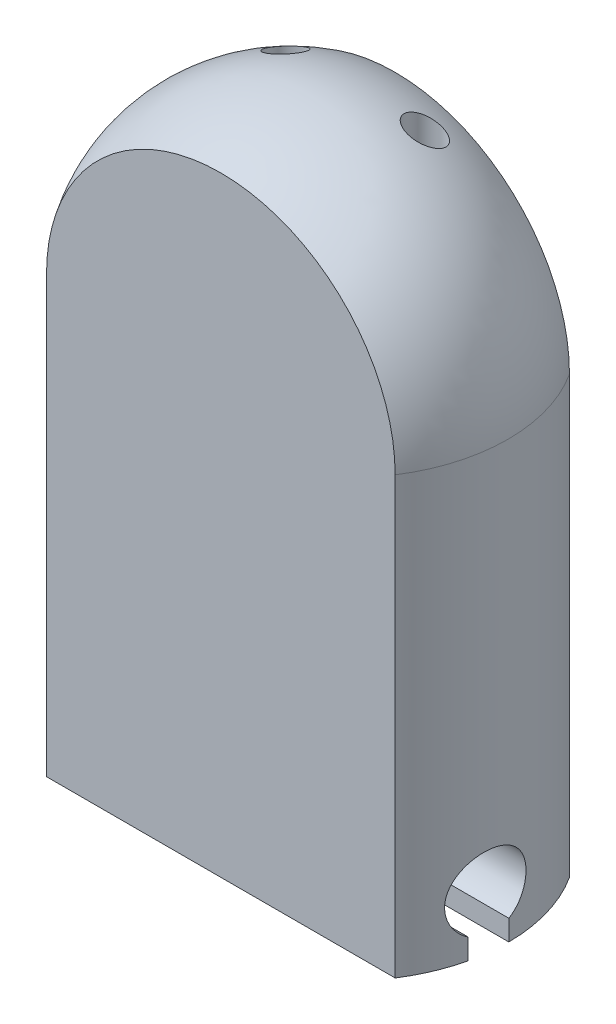
ISO-10303-21;
HEADER;
FILE_DESCRIPTION(('STEP AP214'),'2;1');
FILE_NAME('part.step','',(''),(''),'','','');
FILE_SCHEMA(('AUTOMOTIVE_DESIGN { 1 0 10303 214 1 1 1 1 }'));
ENDSEC;
DATA;
#1=APPLICATION_CONTEXT('core data for automotive mechanical design processes');
#2=APPLICATION_PROTOCOL_DEFINITION('international standard','automotive_design',2000,#1);
#3=PRODUCT_CONTEXT('',#1,'mechanical');
#4=PRODUCT('Part','Part','',(#3));
#5=PRODUCT_RELATED_PRODUCT_CATEGORY('part','',(#4));
#6=PRODUCT_DEFINITION_FORMATION('','',#4);
#7=PRODUCT_DEFINITION_CONTEXT('part definition',#1,'design');
#8=PRODUCT_DEFINITION('design','',#6,#7);
#9=PRODUCT_DEFINITION_SHAPE('','',#8);
#10=(LENGTH_UNIT() NAMED_UNIT(*) SI_UNIT(.MILLI.,.METRE.));
#11=(NAMED_UNIT(*) PLANE_ANGLE_UNIT() SI_UNIT($,.RADIAN.));
#12=(NAMED_UNIT(*) SI_UNIT($,.STERADIAN.) SOLID_ANGLE_UNIT());
#13=UNCERTAINTY_MEASURE_WITH_UNIT(LENGTH_MEASURE(1.E-05),#10,'distance_accuracy_value','');
#14=(GEOMETRIC_REPRESENTATION_CONTEXT(3) GLOBAL_UNCERTAINTY_ASSIGNED_CONTEXT((#13)) GLOBAL_UNIT_ASSIGNED_CONTEXT((#10,
#11,#12)) REPRESENTATION_CONTEXT('',''));
#15=CARTESIAN_POINT('',(0.,0.,0.));
#16=DIRECTION('',(0.,0.,1.));
#17=DIRECTION('',(1.,0.,0.));
#18=AXIS2_PLACEMENT_3D('',#15,#16,#17);
#19=CARTESIAN_POINT('',(10.,0.,10.));
#20=DIRECTION('',(0.,1.,0.));
#21=DIRECTION('',(-1.,0.,0.));
#22=AXIS2_PLACEMENT_3D('',#19,#20,#21);
#23=PLANE('',#22);
#24=DIRECTION('',(1.,0.,0.));
#25=VECTOR('',#24,1.);
#26=CARTESIAN_POINT('',(-14.1,0.,7.05));
#27=LINE('',#26,#25);
#28=CARTESIAN_POINT('',(-11.2414896518679,0.,7.05));
#29=VERTEX_POINT('',#28);
#30=CARTESIAN_POINT('',(11.2414896518679,0.,7.05));
#31=VERTEX_POINT('',#30);
#32=EDGE_CURVE('E113',#29,#31,#27,.T.);
#33=ORIENTED_EDGE('',*,*,#32,.T.);
#34=CARTESIAN_POINT('',(2.24471850597707,0.,5.));
#35=DIRECTION('',(0.,-1.,0.));
#36=DIRECTION('',(1.,0.,0.));
#37=AXIS2_PLACEMENT_3D('',#34,#35,#36);
#38=CIRCLE('',#37,9.22737183880299);
#39=CARTESIAN_POINT('',(10.,0.,10.));
#40=VERTEX_POINT('',#39);
#41=EDGE_CURVE('E174',#31,#40,#38,.T.);
#42=ORIENTED_EDGE('',*,*,#41,.T.);
#43=DIRECTION('',(1.,0.,0.));
#44=VECTOR('',#43,1.);
#45=CARTESIAN_POINT('',(10.,0.,10.));
#46=LINE('',#45,#44);
#47=CARTESIAN_POINT('',(-10.,0.,10.));
#48=VERTEX_POINT('',#47);
#49=EDGE_CURVE('E187',#48,#40,#46,.T.);
#50=ORIENTED_EDGE('',*,*,#49,.F.);
#51=CARTESIAN_POINT('',(-2.24471850597707,0.,5.));
#52=DIRECTION('',(0.,-1.,0.));
#53=DIRECTION('',(-1.,0.,0.));
#54=AXIS2_PLACEMENT_3D('',#51,#52,#53);
#55=CIRCLE('',#54,9.22737183880299);
#56=EDGE_CURVE('E193',#48,#29,#55,.T.);
#57=ORIENTED_EDGE('',*,*,#56,.T.);
#58=EDGE_LOOP('',(#33,#42,#50,#57));
#59=FACE_BOUND('',#58,.T.);
#60=ADVANCED_FACE('F35',(#59),#23,.F.);
#61=CARTESIAN_POINT('',(0.,25.,5.));
#62=DIRECTION('',(0.,0.,-1.));
#63=DIRECTION('',(-1.,0.,0.));
#64=AXIS2_PLACEMENT_3D('',#61,#62,#63);
#65=DEGENERATE_TOROIDAL_SURFACE('',#64,2.24471850597707,9.22737183880299,.T.);
#66=CARTESIAN_POINT('',(3.38209826629685,35.2425533058312,1.50966542253592));
#67=CARTESIAN_POINT('',(3.43076527828559,35.2100257371754,1.47142096657268));
#68=CARTESIAN_POINT('',(3.48302329998592,35.1774619878789,1.43766776958973));
#69=CARTESIAN_POINT('',(3.59341325252713,35.1132453340958,1.38018654195673));
#70=CARTESIAN_POINT('',(3.65155449303211,35.0815939783647,1.35647471823139));
#71=CARTESIAN_POINT('',(3.77241582173914,35.0202017133689,1.32011489612566));
#72=CARTESIAN_POINT('',(3.83514853286662,34.9904665283509,1.3074987421333));
#73=CARTESIAN_POINT('',(3.96328280821704,34.9342191377666,1.29452617177723));
#74=CARTESIAN_POINT('',(4.02868240257652,34.9077046088987,1.29416086499231));
#75=CARTESIAN_POINT('',(4.15474016309742,34.8611412825737,1.30610252508086));
#76=CARTESIAN_POINT('',(4.21536287798553,34.8407464160234,1.31740647069276));
#77=CARTESIAN_POINT('',(4.33478775569603,34.8049064594004,1.35158967146824));
#78=CARTESIAN_POINT('',(4.39359190566903,34.7894557807521,1.37445578154007));
#79=CARTESIAN_POINT('',(4.49927699752838,34.7661305745775,1.42773366379225));
#80=CARTESIAN_POINT('',(4.54670489510151,34.7575229990538,1.45674237818323));
#81=CARTESIAN_POINT('',(4.63646332229525,34.7452074238782,1.52261254883831));
#82=CARTESIAN_POINT('',(4.6787974531872,34.7414959439896,1.55946840553993));
#83=CARTESIAN_POINT('',(4.75298669083986,34.7392451171964,1.63594108951141));
#84=CARTESIAN_POINT('',(4.78545848446129,34.7402418243154,1.67494960677707));
#85=CARTESIAN_POINT('',(4.84400446988884,34.7462552887046,1.75721501644504));
#86=CARTESIAN_POINT('',(4.87007946678454,34.7512715397428,1.80047137326116));
#87=CARTESIAN_POINT('',(4.91499468838777,34.7649535830615,1.88942195059254));
#88=CARTESIAN_POINT('',(4.93391173298489,34.773578401822,1.93508392068369));
#89=CARTESIAN_POINT('',(4.9646903621935,34.7940621693105,2.02802069252039));
#90=CARTESIAN_POINT('',(4.97655048626558,34.8059217867901,2.07529582599595));
#91=CARTESIAN_POINT('',(4.99378146404483,34.8332522717459,2.17332356267032));
#92=CARTESIAN_POINT('',(4.99869101059004,34.8489050048639,2.22410591139444));
#93=CARTESIAN_POINT('',(5.00085163999626,34.882768263535,2.32496655983045));
#94=CARTESIAN_POINT('',(4.99809976867431,34.9009797731616,2.37504458047645));
#95=CARTESIAN_POINT('',(4.98470379928551,34.941404204557,2.47855256619326));
#96=CARTESIAN_POINT('',(4.97327467017647,34.9638361105119,2.53179524120038));
#97=CARTESIAN_POINT('',(4.94229245911977,35.0104919932015,2.63502676884988));
#98=CARTESIAN_POINT('',(4.92273581868972,35.0347167510805,2.68501418513418));
#99=CARTESIAN_POINT('',(4.87380356865887,35.0869443246372,2.78573364494698));
#100=CARTESIAN_POINT('',(4.84362053911773,35.1150785275164,2.83600619326353));
#101=CARTESIAN_POINT('',(4.77522959531926,35.1720971498917,2.93028167283047));
#102=CARTESIAN_POINT('',(4.73701858027875,35.2009818554783,2.97428217046737));
#103=CARTESIAN_POINT('',(4.650767344324,35.2607961089178,3.05772091757074));
#104=CARTESIAN_POINT('',(4.60223760074474,35.2917320179963,3.09665040013956));
#105=CARTESIAN_POINT('',(4.49850305943716,35.3529200031507,3.16503241904892));
#106=CARTESIAN_POINT('',(4.44329699852033,35.3831719485283,3.19448315809812));
#107=CARTESIAN_POINT('',(4.32732355000367,35.4423597557036,3.24293254412498));
#108=CARTESIAN_POINT('',(4.26652497967342,35.4712866996506,3.26186785439405));
#109=CARTESIAN_POINT('',(4.14137786112123,35.5267409744238,3.28793567579502));
#110=CARTESIAN_POINT('',(4.07703018365847,35.5532688896631,3.2950710687956));
#111=CARTESIAN_POINT('',(3.95076686898685,35.6014603353464,3.29658102902806));
#112=CARTESIAN_POINT('',(3.88893625968993,35.6233200046814,3.2916939773896));
#113=CARTESIAN_POINT('',(3.76606510142036,35.663167980679,3.27016680897112));
#114=CARTESIAN_POINT('',(3.70502399566902,35.681159173136,3.25353549309809));
#115=CARTESIAN_POINT('',(3.592197253086,35.7107879373786,3.21077582134245));
#116=CARTESIAN_POINT('',(3.54010159288697,35.7228855201247,3.1857849893393));
#117=CARTESIAN_POINT('',(3.44041740502876,35.7426344527007,3.12671293481586));
#118=CARTESIAN_POINT('',(3.39282551261795,35.750289144104,3.09263857239437));
#119=CARTESIAN_POINT('',(3.30832696135695,35.7602018543317,3.02006658008115));
#120=CARTESIAN_POINT('',(3.27083245156269,35.7629091440468,2.98231247147958));
#121=CARTESIAN_POINT('',(3.20229268763142,35.7641596081001,2.90129262382811));
#122=CARTESIAN_POINT('',(3.17124523573158,35.7627042039831,2.85802877115706));
#123=CARTESIAN_POINT('',(3.11779399242855,35.7558153613669,2.76948595212442));
#124=CARTESIAN_POINT('',(3.09505698554899,35.7505689194314,2.72439258151227));
#125=CARTESIAN_POINT('',(3.05676046181683,35.7364901375535,2.63179260218933));
#126=CARTESIAN_POINT('',(3.04120121772431,35.7276576613632,2.58428590184643));
#127=CARTESIAN_POINT('',(3.01715562995184,35.7064906094799,2.48716275148727));
#128=CARTESIAN_POINT('',(3.00882721400125,35.694085359054,2.43752291475601));
#129=CARTESIAN_POINT('',(2.99966284700205,35.666274105335,2.33840597591295));
#130=CARTESIAN_POINT('',(2.99882858696786,35.6508674255873,2.28892891304769));
#131=CARTESIAN_POINT('',(3.00450450423601,35.6162079666798,2.18743174061207));
#132=CARTESIAN_POINT('',(3.01159392477066,35.5967486752805,2.13551519447339));
#133=CARTESIAN_POINT('',(3.0334399736004,35.555454415623,2.03429841828109));
#134=CARTESIAN_POINT('',(3.04820179643941,35.5336178457741,1.98499998575708));
#135=CARTESIAN_POINT('',(3.08668983224046,35.4856506364006,1.88476003089643));
#136=CARTESIAN_POINT('',(3.11121915027862,35.4593114961987,1.83422730390968));
#137=CARTESIAN_POINT('',(3.16786757514281,35.4051479550586,1.73856685488531));
#138=CARTESIAN_POINT('',(3.1999811356394,35.3773246509406,1.69343521921825));
#139=CARTESIAN_POINT('',(3.25742895653925,35.3315562448023,1.62528133658781));
#140=CARTESIAN_POINT('',(3.28073467219167,35.3138543491277,1.60035211860752));
#141=CARTESIAN_POINT('',(3.32969819038032,35.2782897167754,1.55305163748689));
#142=CARTESIAN_POINT('',(3.35535608922815,35.2604269735387,1.53068047917227));
#143=CARTESIAN_POINT('',(3.38209826629685,35.2425533058312,1.50966542253592));
#144=B_SPLINE_CURVE_WITH_KNOTS('',3,(#66,#67,#68,#69,#70,#71,#72,#73,#74,#75,#76,#77,#78,#79,
#80,#81,#82,#83,#84,#85,#86,#87,#88,#89,#90,#91,#92,#93,#94,#95,#96,#97,#98,#99,#100,#101,#102,
#103,#104,#105,#106,#107,#108,#109,#110,#111,#112,#113,#114,#115,#116,#117,#118,#119,#120,#121,
#122,#123,#124,#125,#126,#127,#128,#129,#130,#131,#132,#133,#134,#135,#136,#137,#138,#139,#140,
#141,#142,#143),.UNSPECIFIED.,.T.,.F.,(4,2,2,2,2,2,2,2,2,2,2,2,2,2,2,2,2,2,2,2,2,2,2,2,2,2,2,2,
2,2,2,2,2,2,2,2,2,2,4),(0.,0.209632821516562,0.419602715705379,0.630173271795878,
0.840591013844422,1.03431583669492,1.22782090622288,1.39566075358494,1.56338123282903,
1.71493936666252,1.86647841585901,2.01634160484562,2.16623579957009,2.32567480566421,
2.48517529870871,2.66113322287754,2.8371682683087,3.03144284536328,3.2257925987467,
3.43326721222957,3.64078114241535,3.84953178075872,4.05823142884463,4.25443681244325,
4.45049531963276,4.62661986695186,4.80261177580224,4.96163059517454,5.12059511668228,
5.27221142244772,5.42383348926598,5.57868933711383,5.73358012644132,5.90057936655862,
6.06769181985956,6.2530594484434,6.43829193582082,6.55347896225643,6.6686707072048),.UNSPECIFIED.);
#145=CARTESIAN_POINT('',(3.38209826629685,35.2425533058312,1.50966542253592));
#146=VERTEX_POINT('',#145);
#147=EDGE_CURVE('E169',#146,#146,#144,.T.);
#148=ORIENTED_EDGE('',*,*,#147,.T.);
#149=EDGE_LOOP('',(#148));
#150=FACE_BOUND('',#149,.T.);
#151=CARTESIAN_POINT('',(-2.24471850597707,25.,5.));
#152=DIRECTION('',(0.,-1.,0.));
#153=DIRECTION('',(-1.,0.,0.));
#154=AXIS2_PLACEMENT_3D('',#151,#152,#153);
#155=CIRCLE('',#154,9.22737183880299);
#156=CARTESIAN_POINT('',(-10.,25.,10.));
#157=VERTEX_POINT('',#156);
#158=CARTESIAN_POINT('',(-10.,25.,0.));
#159=VERTEX_POINT('',#158);
#160=EDGE_CURVE('E185',#157,#159,#155,.T.);
#161=ORIENTED_EDGE('',*,*,#160,.F.);
#162=CARTESIAN_POINT('',(0.,25.,10.));
#163=DIRECTION('',(0.,0.,1.));
#164=DIRECTION('',(1.,0.,0.));
#165=AXIS2_PLACEMENT_3D('',#162,#163,#164);
#166=CIRCLE('',#165,10.);
#167=CARTESIAN_POINT('',(10.,25.,10.));
#168=VERTEX_POINT('',#167);
#169=EDGE_CURVE('E58',#168,#157,#166,.T.);
#170=ORIENTED_EDGE('',*,*,#169,.F.);
#171=CARTESIAN_POINT('',(2.24471850597707,25.,5.));
#172=DIRECTION('',(0.,-1.,0.));
#173=DIRECTION('',(1.,0.,0.));
#174=AXIS2_PLACEMENT_3D('',#171,#172,#173);
#175=CIRCLE('',#174,9.22737183880299);
#176=CARTESIAN_POINT('',(10.,25.,0.));
#177=VERTEX_POINT('',#176);
#178=EDGE_CURVE('E199',#177,#168,#175,.T.);
#179=ORIENTED_EDGE('',*,*,#178,.F.);
#180=CARTESIAN_POINT('',(0.,25.,0.));
#181=DIRECTION('',(0.,0.,1.));
#182=DIRECTION('',(1.,0.,0.));
#183=AXIS2_PLACEMENT_3D('',#180,#181,#182);
#184=CIRCLE('',#183,10.);
#185=EDGE_CURVE('E183',#177,#159,#184,.T.);
#186=ORIENTED_EDGE('',*,*,#185,.T.);
#187=EDGE_LOOP('',(#161,#170,#179,#186));
#188=FACE_BOUND('',#187,.T.);
#189=CARTESIAN_POINT('',(-4.82931550138741,34.7449460830842,1.73714011879176));
#190=CARTESIAN_POINT('',(-4.85897155075556,34.7488211752637,1.78116010773996));
#191=CARTESIAN_POINT('',(-4.88505160898795,34.7549068362434,1.82746769207561));
#192=CARTESIAN_POINT('',(-4.92939753377293,34.7711318908707,1.92308055790369));
#193=CARTESIAN_POINT('',(-4.94764703931364,34.7812796872383,1.97239187237055));
#194=CARTESIAN_POINT('',(-4.97603545922373,34.805054574608,2.07223331748554));
#195=CARTESIAN_POINT('',(-4.98620844642522,34.8186667255864,2.12275739138314));
#196=CARTESIAN_POINT('',(-4.99870114422331,34.8488138810336,2.2238619413315));
#197=CARTESIAN_POINT('',(-5.00102259973231,34.8653482352168,2.274442402351));
#198=CARTESIAN_POINT('',(-4.99806468581594,34.901973884386,2.37790770159529));
#199=CARTESIAN_POINT('',(-4.99226367452434,34.9222296038785,2.43071876301895));
#200=CARTESIAN_POINT('',(-4.97267478830654,34.9647997408113,2.53397236763395));
#201=CARTESIAN_POINT('',(-4.95888330738015,34.9871150839094,2.58441383033649));
#202=CARTESIAN_POINT('',(-4.92202875585938,35.0357513734038,2.68728169484815));
#203=CARTESIAN_POINT('',(-4.89811806838382,35.0622436821695,2.73932390700805));
#204=CARTESIAN_POINT('',(-4.84213736186128,35.1163585940197,2.83817019859676));
#205=CARTESIAN_POINT('',(-4.81006384600068,35.1439816772421,2.88497202072991));
#206=CARTESIAN_POINT('',(-4.73571038668432,35.2020356356125,2.97596505122096));
#207=CARTESIAN_POINT('',(-4.69280541660798,35.2325096794882,3.01961960456416));
#208=CARTESIAN_POINT('',(-4.59969928810562,35.2932844845075,3.09846945673699));
#209=CARTESIAN_POINT('',(-4.54949617858651,35.3235851970539,3.13366248675494));
#210=CARTESIAN_POINT('',(-4.44160666595084,35.3840906255619,3.1953370395903));
#211=CARTESIAN_POINT('',(-4.38375137014356,35.4142693854684,3.22154996505367));
#212=CARTESIAN_POINT('',(-4.26327888199099,35.4727943536481,3.2627375419184));
#213=CARTESIAN_POINT('',(-4.2006620321396,35.5011406934546,3.27771300077916));
#214=CARTESIAN_POINT('',(-4.0750816075226,35.5539988765733,3.29503031890629));
#215=CARTESIAN_POINT('',(-4.01223005098326,35.5786181426981,3.29784918902433));
#216=CARTESIAN_POINT('',(-3.88586990932317,35.6243912559242,3.29139473124687));
#217=CARTESIAN_POINT('',(-3.82236175152439,35.6455472225017,3.28212883038272));
#218=CARTESIAN_POINT('',(-3.70287174932256,35.6816755428914,3.25255387191019));
#219=CARTESIAN_POINT('',(-3.64673680138964,35.6970386975614,3.2333446464444));
#220=CARTESIAN_POINT('',(-3.53794238207996,35.7233907933449,3.18476408870658));
#221=CARTESIAN_POINT('',(-3.48528009286462,35.7343833183011,3.15540111943077));
#222=CARTESIAN_POINT('',(-3.39076536916716,35.7504944471828,3.09075739217968));
#223=CARTESIAN_POINT('',(-3.34835828625274,35.7561045483341,3.05640801473796));
#224=CARTESIAN_POINT('',(-3.26954231389982,35.7630094897265,2.98104798463276));
#225=CARTESIAN_POINT('',(-3.23313052084894,35.7643064247789,2.94004057578404));
#226=CARTESIAN_POINT('',(-3.16971617249759,35.7625334824134,2.85559242590472));
#227=CARTESIAN_POINT('',(-3.14225071266067,35.7597466255203,2.81249177450581));
#228=CARTESIAN_POINT('',(-3.09433398862681,35.7503927597599,2.72294206460183));
#229=CARTESIAN_POINT('',(-3.07388219077948,35.7438260385941,2.67649326117413));
#230=CARTESIAN_POINT('',(-3.04037327886544,35.7271515619149,2.58165716006855));
#231=CARTESIAN_POINT('',(-3.02731147214679,35.7170460601467,2.53327111349365));
#232=CARTESIAN_POINT('',(-3.00859642581218,35.6936442081511,2.43585306922106));
#233=CARTESIAN_POINT('',(-3.00294473577088,35.680347191214,2.38682093858134));
#234=CARTESIAN_POINT('',(-2.99870414931695,35.6500696301855,2.28627308707602));
#235=CARTESIAN_POINT('',(-3.00057516209123,35.6329117449287,2.23479199794083));
#236=CARTESIAN_POINT('',(-3.01194171990511,35.5960056048864,2.13364213061195));
#237=CARTESIAN_POINT('',(-3.02144016883791,35.5762563659252,2.08397405019183));
#238=CARTESIAN_POINT('',(-3.04879524450874,35.5325667670072,1.98247742896298));
#239=CARTESIAN_POINT('',(-3.06740832387275,35.5084043180877,1.93094868159637));
#240=CARTESIAN_POINT('',(-3.11230012758791,35.4582510588804,1.83231653008966));
#241=CARTESIAN_POINT('',(-3.13858234069393,35.4322594205709,1.78521515291986));
#242=CARTESIAN_POINT('',(-3.20118213189552,35.3761872837701,1.6914351370427));
#243=CARTESIAN_POINT('',(-3.23827975324378,35.3459693420512,1.64535834803874));
#244=CARTESIAN_POINT('',(-3.31971309951013,35.2848779330671,1.56062047352339));
#245=CARTESIAN_POINT('',(-3.36405204736648,35.254004179263,1.52196270677876));
#246=CARTESIAN_POINT('',(-3.46226922272306,35.1902015706652,1.45046668893687));
#247=CARTESIAN_POINT('',(-3.51660254308539,35.1572833942558,1.41824112062478));
#248=CARTESIAN_POINT('',(-3.63096289783917,35.0926374925363,1.36435874597182));
#249=CARTESIAN_POINT('',(-3.69099124431696,35.0609100439212,1.34270438224479));
#250=CARTESIAN_POINT('',(-3.81473762682623,34.9999996099694,1.31117523741809));
#251=CARTESIAN_POINT('',(-3.87842482092308,34.9707994193819,1.30121384525884));
#252=CARTESIAN_POINT('',(-4.00803646379647,34.9159299947538,1.29385302248609));
#253=CARTESIAN_POINT('',(-4.07395941141959,34.8902584477812,1.2964453224913));
#254=CARTESIAN_POINT('',(-4.1993327511187,34.8460436946798,1.31414609545704));
#255=CARTESIAN_POINT('',(-4.25879593352612,34.8270523921849,1.32802696344181));
#256=CARTESIAN_POINT('',(-4.37541140685775,34.7941037129717,1.36703277954652));
#257=CARTESIAN_POINT('',(-4.43256562297014,34.780142062327,1.39214814032046));
#258=CARTESIAN_POINT('',(-4.53474316630585,34.7595939200458,1.44915612581484));
#259=CARTESIAN_POINT('',(-4.58037026520556,34.7522751424298,1.47970913088257));
#260=CARTESIAN_POINT('',(-4.66622976755253,34.7424649655203,1.54816677211798));
#261=CARTESIAN_POINT('',(-4.70647442728435,34.7399624188879,1.58605420804094));
#262=CARTESIAN_POINT('',(-4.75890122586081,34.7398717766053,1.64429340972148));
#263=CARTESIAN_POINT('',(-4.7739043858315,34.7402842675887,1.66218874210061));
#264=CARTESIAN_POINT('',(-4.80260619617663,34.7419714381058,1.6989560603568));
#265=CARTESIAN_POINT('',(-4.81630498389558,34.7432460267497,1.71782794308382));
#266=CARTESIAN_POINT('',(-4.82931550138741,34.7449460830842,1.73714011879176));
#267=B_SPLINE_CURVE_WITH_KNOTS('',3,(#189,#190,#191,#192,#193,#194,#195,#196,#197,#198,#199,
#200,#201,#202,#203,#204,#205,#206,#207,#208,#209,#210,#211,#212,#213,#214,#215,#216,#217,#218,
#219,#220,#221,#222,#223,#224,#225,#226,#227,#228,#229,#230,#231,#232,#233,#234,#235,#236,#237,
#238,#239,#240,#241,#242,#243,#244,#245,#246,#247,#248,#249,#250,#251,#252,#253,#254,#255,#256,
#257,#258,#259,#260,#261,#262,#263,#264,#265,#266),.UNSPECIFIED.,.T.,.F.,(4,2,2,2,2,2,2,2,2,2,2,
2,2,2,2,2,2,2,2,2,2,2,2,2,2,2,2,2,2,2,2,2,2,2,2,2,2,2,4),(0.,0.159561472824534,
0.319454725974144,0.47866979040063,0.637849468788893,0.807733728328696,0.977694714318475,
1.16620506196725,1.35479630049602,1.55899616483259,1.76325072093539,1.97316859458526,
2.18307138330536,2.38465827685494,2.58612133794634,2.76896393036502,2.95165628419744,
3.115373851413,3.27901189293084,3.43183186842769,3.58464021368854,3.73735141627167,
3.89009454813438,4.05231347697109,4.21459419457864,4.39349685274606,4.57248102248604,
4.77091007183483,4.96942767901821,5.18212108222835,5.39486360777218,5.60602017945353,
5.81703767678346,6.00776244345867,6.19832475810505,6.36362762771708,6.52854743560578,
6.59855663217211,6.66855844891563),.UNSPECIFIED.);
#268=CARTESIAN_POINT('',(-4.82931550138741,34.7449460830842,1.73714011879176));
#269=VERTEX_POINT('',#268);
#270=EDGE_CURVE('E151',#269,#269,#267,.T.);
#271=ORIENTED_EDGE('',*,*,#270,.F.);
#272=EDGE_LOOP('',(#271));
#273=FACE_BOUND('',#272,.T.);
#274=ADVANCED_FACE('F162',(#150,#188,#273),#65,.T.);
#275=CARTESIAN_POINT('',(-4.,0.,2.2959207547828));
#276=DIRECTION('',(0.,-1.,0.));
#277=DIRECTION('',(1.,0.,0.));
#278=AXIS2_PLACEMENT_3D('',#275,#276,#277);
#279=CIRCLE('',#278,1.);
#280=CARTESIAN_POINT('',(-3.,0.,2.2959207547828));
#281=VERTEX_POINT('',#280);
#282=EDGE_CURVE('E204',#281,#281,#279,.F.);
#283=ORIENTED_EDGE('',*,*,#282,.T.);
#284=EDGE_LOOP('',(#283));
#285=FACE_BOUND('',#284,.T.);
#286=CARTESIAN_POINT('',(4.,0.,2.2959207547828));
#287=DIRECTION('',(0.,-1.,0.));
#288=DIRECTION('',(1.,0.,0.));
#289=AXIS2_PLACEMENT_3D('',#286,#287,#288);
#290=CIRCLE('',#289,1.);
#291=CARTESIAN_POINT('',(5.,0.,2.2959207547828));
#292=VERTEX_POINT('',#291);
#293=EDGE_CURVE('E175',#292,#292,#290,.T.);
#294=ORIENTED_EDGE('',*,*,#293,.F.);
#295=EDGE_LOOP('',(#294));
#296=FACE_BOUND('',#295,.T.);
#297=CARTESIAN_POINT('',(10.,0.,0.));
#298=VERTEX_POINT('',#297);
#299=CARTESIAN_POINT('',(11.4719548772604,0.,4.95));
#300=VERTEX_POINT('',#299);
#301=EDGE_CURVE('E197',#298,#300,#38,.T.);
#302=ORIENTED_EDGE('',*,*,#301,.T.);
#303=DIRECTION('',(1.,0.,0.));
#304=VECTOR('',#303,1.);
#305=CARTESIAN_POINT('',(-14.1,0.,4.95));
#306=LINE('',#305,#304);
#307=CARTESIAN_POINT('',(-11.4719548772604,0.,4.95));
#308=VERTEX_POINT('',#307);
#309=EDGE_CURVE('E127',#308,#300,#306,.T.);
#310=ORIENTED_EDGE('',*,*,#309,.F.);
#311=CARTESIAN_POINT('',(-10.,0.,0.));
#312=VERTEX_POINT('',#311);
#313=EDGE_CURVE('E78',#308,#312,#55,.T.);
#314=ORIENTED_EDGE('',*,*,#313,.T.);
#315=DIRECTION('',(1.,0.,0.));
#316=VECTOR('',#315,1.);
#317=CARTESIAN_POINT('',(10.,0.,0.));
#318=LINE('',#317,#316);
#319=EDGE_CURVE('E71',#312,#298,#318,.T.);
#320=ORIENTED_EDGE('',*,*,#319,.T.);
#321=EDGE_LOOP('',(#302,#310,#314,#320));
#322=FACE_BOUND('',#321,.T.);
#323=ADVANCED_FACE('F37',(#285,#296,#322),#23,.F.);
#324=CARTESIAN_POINT('',(0.,25.,10.));
#325=DIRECTION('',(0.,0.,1.));
#326=DIRECTION('',(1.,0.,0.));
#327=AXIS2_PLACEMENT_3D('',#324,#325,#326);
#328=PLANE('',#327);
#329=ORIENTED_EDGE('',*,*,#169,.T.);
#330=DIRECTION('',(0.,-1.,0.));
#331=VECTOR('',#330,1.);
#332=CARTESIAN_POINT('',(-10.,0.,10.));
#333=LINE('',#332,#331);
#334=EDGE_CURVE('E190',#157,#48,#333,.T.);
#335=ORIENTED_EDGE('',*,*,#334,.T.);
#336=ORIENTED_EDGE('',*,*,#49,.T.);
#337=DIRECTION('',(0.,1.,0.));
#338=VECTOR('',#337,1.);
#339=CARTESIAN_POINT('',(10.,25.,10.));
#340=LINE('',#339,#338);
#341=EDGE_CURVE('E150',#40,#168,#340,.T.);
#342=ORIENTED_EDGE('',*,*,#341,.T.);
#343=EDGE_LOOP('',(#329,#335,#336,#342));
#344=FACE_BOUND('',#343,.T.);
#345=ADVANCED_FACE('F221',(#344),#328,.T.);
#346=CARTESIAN_POINT('',(0.,25.,0.));
#347=DIRECTION('',(0.,0.,1.));
#348=DIRECTION('',(1.,0.,0.));
#349=AXIS2_PLACEMENT_3D('',#346,#347,#348);
#350=PLANE('',#349);
#351=ORIENTED_EDGE('',*,*,#185,.F.);
#352=DIRECTION('',(0.,1.,0.));
#353=VECTOR('',#352,1.);
#354=CARTESIAN_POINT('',(10.,25.,0.));
#355=LINE('',#354,#353);
#356=EDGE_CURVE('E176',#298,#177,#355,.T.);
#357=ORIENTED_EDGE('',*,*,#356,.F.);
#358=ORIENTED_EDGE('',*,*,#319,.F.);
#359=DIRECTION('',(0.,-1.,0.));
#360=VECTOR('',#359,1.);
#361=CARTESIAN_POINT('',(-10.,0.,0.));
#362=LINE('',#361,#360);
#363=EDGE_CURVE('E180',#159,#312,#362,.T.);
#364=ORIENTED_EDGE('',*,*,#363,.F.);
#365=EDGE_LOOP('',(#351,#357,#358,#364));
#366=FACE_BOUND('',#365,.T.);
#367=ADVANCED_FACE('F214',(#366),#350,.F.);
#368=CARTESIAN_POINT('',(-2.24471850597707,25.,5.));
#369=DIRECTION('',(0.,-1.,0.));
#370=DIRECTION('',(1.,0.,0.));
#371=AXIS2_PLACEMENT_3D('',#368,#369,#370);
#372=CYLINDRICAL_SURFACE('',#371,9.22737183880299);
#373=DIRECTION('',(0.,-1.,0.));
#374=VECTOR('',#373,1.);
#375=CARTESIAN_POINT('',(-11.4719548772604,25.,4.95));
#376=LINE('',#375,#374);
#377=CARTESIAN_POINT('',(-11.4719548772604,1.18134665205268,4.95));
#378=VERTEX_POINT('',#377);
#379=EDGE_CURVE('E118',#378,#308,#376,.T.);
#380=ORIENTED_EDGE('',*,*,#379,.F.);
#381=CARTESIAN_POINT('',(-11.4719548772604,1.18134665205268,4.95));
#382=CARTESIAN_POINT('',(-11.4716797140268,1.2108233791891,4.89894489081654));
#383=CARTESIAN_POINT('',(-11.4709844660715,1.24243520789881,4.84915950719251));
#384=CARTESIAN_POINT('',(-11.4688952949244,1.30971716294848,4.75243545499501));
#385=CARTESIAN_POINT('',(-11.4675014587466,1.34538678343512,4.70549643270383));
#386=CARTESIAN_POINT('',(-11.4624899069958,1.45804294624164,4.56955207770933));
#387=CARTESIAN_POINT('',(-11.4580401645091,1.54078290871447,4.48523613562701));
#388=CARTESIAN_POINT('',(-11.4481799004561,1.71913784941992,4.3316889742785));
#389=CARTESIAN_POINT('',(-11.4427692079313,1.81475511786516,4.26246044403683));
#390=CARTESIAN_POINT('',(-11.4322191165329,2.01623276583191,4.14095973042672));
#391=CARTESIAN_POINT('',(-11.4270796872109,2.12209199193232,4.08868564057491));
#392=CARTESIAN_POINT('',(-11.4181067381766,2.34160150279983,4.00238066729886));
#393=CARTESIAN_POINT('',(-11.4142791159111,2.45528428231271,3.96843178503714));
#394=CARTESIAN_POINT('',(-11.4087162541065,2.68680207915544,3.920122704124));
#395=CARTESIAN_POINT('',(-11.4069811683489,2.80463740100265,3.90576394514956));
#396=CARTESIAN_POINT('',(-11.405942072616,3.04034400478781,3.89709777627074));
#397=CARTESIAN_POINT('',(-11.406623546411,3.15821083356186,3.9026706392049));
#398=CARTESIAN_POINT('',(-11.4102552159612,3.39131207969297,3.93343400093978));
#399=CARTESIAN_POINT('',(-11.4132052996676,3.50654662677138,3.95862353085626));
#400=CARTESIAN_POINT('',(-11.4207995740263,3.73094894402067,4.02782383532503));
#401=CARTESIAN_POINT('',(-11.4254410112882,3.84012624394221,4.07180404009415));
#402=CARTESIAN_POINT('',(-11.4354971886069,4.04959713511865,4.17733665157744));
#403=CARTESIAN_POINT('',(-11.440911989971,4.14989002105452,4.23889045179533));
#404=CARTESIAN_POINT('',(-11.4513921067543,4.33946359273291,4.37834156877572));
#405=CARTESIAN_POINT('',(-11.4564548155869,4.42866535181048,4.45634643073758));
#406=CARTESIAN_POINT('',(-11.4649105710601,4.59274347477998,4.6262765448318));
#407=CARTESIAN_POINT('',(-11.4683036628471,4.66762022598626,4.71820142047948));
#408=CARTESIAN_POINT('',(-11.4721937860274,4.80070828455398,4.91310749468779));
#409=CARTESIAN_POINT('',(-11.4726987211766,4.85896465933062,5.01605773279407));
#410=CARTESIAN_POINT('',(-11.4698386149949,4.95737621049316,5.2302198358588));
#411=CARTESIAN_POINT('',(-11.4664740612179,4.99753366644775,5.34143065833579));
#412=CARTESIAN_POINT('',(-11.4553307743808,5.05815919926419,5.5670756489188));
#413=CARTESIAN_POINT('',(-11.4476193726546,5.07891506149234,5.68143591835325));
#414=CARTESIAN_POINT('',(-11.4276750358483,5.10132328604985,5.91161524227984));
#415=CARTESIAN_POINT('',(-11.4154422177291,5.1029761425034,6.02743425896201));
#416=CARTESIAN_POINT('',(-11.3867994281161,5.08737985608291,6.25702424938727));
#417=CARTESIAN_POINT('',(-11.3703975542999,5.07016714410008,6.37079874072636));
#418=CARTESIAN_POINT('',(-11.3341549835427,5.01763266296326,6.59351072162996));
#419=CARTESIAN_POINT('',(-11.3143137952457,4.98230830488436,6.70244751726224));
#420=CARTESIAN_POINT('',(-11.2717451649269,4.89352962343205,6.91554177531225));
#421=CARTESIAN_POINT('',(-11.248955547695,4.83962299770151,7.01949824387683));
#422=CARTESIAN_POINT('',(-11.2023989352762,4.71544592330843,7.2169017583023));
#423=CARTESIAN_POINT('',(-11.178631717297,4.64517172732015,7.31034639022064));
#424=CARTESIAN_POINT('',(-11.1311044620591,4.4876988930727,7.48699760984618));
#425=CARTESIAN_POINT('',(-11.1073655397532,4.4000601549571,7.56981840396051));
#426=CARTESIAN_POINT('',(-11.0625765444743,4.21147695890428,7.71953926935973));
#427=CARTESIAN_POINT('',(-11.0415264271699,4.11053272039544,7.78643960314673));
#428=CARTESIAN_POINT('',(-11.0042209301792,3.89907824534743,7.90157686327343));
#429=CARTESIAN_POINT('',(-10.9879176410932,3.78867927340874,7.95000192536886));
#430=CARTESIAN_POINT('',(-10.9614314950089,3.56057020867337,8.02737482919081));
#431=CARTESIAN_POINT('',(-10.9512460179452,3.4428632695128,8.0563310094588));
#432=CARTESIAN_POINT('',(-10.93841610692,3.20994118076732,8.09263078651425));
#433=CARTESIAN_POINT('',(-10.9354133192356,3.09490547599658,8.10100203592302));
#434=CARTESIAN_POINT('',(-10.9361964989241,2.86504932868677,8.09880705311302));
#435=CARTESIAN_POINT('',(-10.9399812827577,2.75022885211329,8.08824412242103));
#436=CARTESIAN_POINT('',(-10.9537394746446,2.52769250079192,8.04922056414474));
#437=CARTESIAN_POINT('',(-10.9635215990453,2.41986676568024,8.02131278243955));
#438=CARTESIAN_POINT('',(-10.9882149178137,2.21048567082701,7.94908588181125));
#439=CARTESIAN_POINT('',(-11.0031270182869,2.1089314225557,7.90476386354272));
#440=CARTESIAN_POINT('',(-11.0373134100319,1.9117636686982,7.79960683867675));
#441=CARTESIAN_POINT('',(-11.0567001176214,1.81640265097529,7.73833639113622));
#442=CARTESIAN_POINT('',(-11.0980267037485,1.63708746073188,7.60161681055632));
#443=CARTESIAN_POINT('',(-11.1199663707204,1.55313234424315,7.52616885210063));
#444=CARTESIAN_POINT('',(-11.1587959975557,1.41917251377466,7.3848374301588));
#445=CARTESIAN_POINT('',(-11.1754702933117,1.36608792109949,7.32177829825349));
#446=CARTESIAN_POINT('',(-11.2087044565349,1.26774346620273,7.18997584389511));
#447=CARTESIAN_POINT('',(-11.2252644707756,1.22247039777112,7.12124241124579));
#448=CARTESIAN_POINT('',(-11.2414896518679,1.18134665205268,7.05));
#449=B_SPLINE_CURVE_WITH_KNOTS('',3,(#381,#382,#383,#384,#385,#386,#387,#388,#389,#390,#391,
#392,#393,#394,#395,#396,#397,#398,#399,#400,#401,#402,#403,#404,#405,#406,#407,#408,#409,#410,
#411,#412,#413,#414,#415,#416,#417,#418,#419,#420,#421,#422,#423,#424,#425,#426,#427,#428,#429,
#430,#431,#432,#433,#434,#435,#436,#437,#438,#439,#440,#441,#442,#443,#444,#445,#446,#447,#448),
.UNSPECIFIED.,.F.,.F.,(4,2,2,2,2,2,2,2,2,2,2,2,2,2,2,2,2,2,2,2,2,2,2,2,2,2,2,2,2,2,2,2,2,4),(0.,
0.176749631097543,0.353477252290979,0.706305176332776,1.0591959334467,1.41204699513089,
1.76646416506054,2.12090737968386,2.47322507645057,2.82552537304322,3.17725469603359,
3.5290119172599,3.88314420285529,4.23726691219728,4.5904200606982,4.94352871692885,
5.29131246419976,5.63908721556994,5.9861915680088,6.33334555026766,6.68962792804756,
7.04599195635867,7.41292412714886,7.77985024741422,8.14293330028706,8.50586074509633,
8.85026477048811,9.19460874846818,9.5285033536094,9.86245696471682,10.2059478681016,
10.5494103263615,10.8011745437185,11.0525088653119),.UNSPECIFIED.);
#450=CARTESIAN_POINT('',(-11.2414896518679,1.18134665205268,7.05));
#451=VERTEX_POINT('',#450);
#452=EDGE_CURVE('E119',#378,#451,#449,.T.);
#453=ORIENTED_EDGE('',*,*,#452,.T.);
#454=DIRECTION('',(0.,-1.,0.));
#455=VECTOR('',#454,1.);
#456=CARTESIAN_POINT('',(-11.2414896518679,25.,7.05));
#457=LINE('',#456,#455);
#458=EDGE_CURVE('E107',#451,#29,#457,.T.);
#459=ORIENTED_EDGE('',*,*,#458,.T.);
#460=ORIENTED_EDGE('',*,*,#56,.F.);
#461=ORIENTED_EDGE('',*,*,#334,.F.);
#462=ORIENTED_EDGE('',*,*,#160,.T.);
#463=ORIENTED_EDGE('',*,*,#363,.T.);
#464=ORIENTED_EDGE('',*,*,#313,.F.);
#465=EDGE_LOOP('',(#380,#453,#459,#460,#461,#462,#463,#464));
#466=FACE_BOUND('',#465,.T.);
#467=ADVANCED_FACE('F126',(#466),#372,.T.);
#468=CARTESIAN_POINT('',(2.24471850597707,25.,5.));
#469=DIRECTION('',(0.,-1.,0.));
#470=DIRECTION('',(1.,0.,0.));
#471=AXIS2_PLACEMENT_3D('',#468,#469,#470);
#472=CYLINDRICAL_SURFACE('',#471,9.22737183880299);
#473=DIRECTION('',(0.,-1.,0.));
#474=VECTOR('',#473,1.);
#475=CARTESIAN_POINT('',(11.4719548772604,25.,4.95));
#476=LINE('',#475,#474);
#477=CARTESIAN_POINT('',(11.4719548772604,1.18134665205268,4.95));
#478=VERTEX_POINT('',#477);
#479=EDGE_CURVE('E11',#300,#478,#476,.F.);
#480=ORIENTED_EDGE('',*,*,#479,.F.);
#481=ORIENTED_EDGE('',*,*,#301,.F.);
#482=ORIENTED_EDGE('',*,*,#356,.T.);
#483=ORIENTED_EDGE('',*,*,#178,.T.);
#484=ORIENTED_EDGE('',*,*,#341,.F.);
#485=ORIENTED_EDGE('',*,*,#41,.F.);
#486=DIRECTION('',(0.,-1.,0.));
#487=VECTOR('',#486,1.);
#488=CARTESIAN_POINT('',(11.2414896518679,25.,7.05));
#489=LINE('',#488,#487);
#490=CARTESIAN_POINT('',(11.2414896518679,1.18134665205268,7.05));
#491=VERTEX_POINT('',#490);
#492=EDGE_CURVE('E43',#31,#491,#489,.F.);
#493=ORIENTED_EDGE('',*,*,#492,.T.);
#494=CARTESIAN_POINT('',(11.2414896518679,1.18134665205268,7.05));
#495=CARTESIAN_POINT('',(11.2296928233924,1.21124418518983,7.10177950787452));
#496=CARTESIAN_POINT('',(11.2177255088372,1.24331807649276,7.15222794149612));
#497=CARTESIAN_POINT('',(11.1936611425849,1.31162936023286,7.25019018122077));
#498=CARTESIAN_POINT('',(11.1815640900437,1.34786677977148,7.29770396821837));
#499=CARTESIAN_POINT('',(11.1453904112386,1.46255574958451,7.43545271271364));
#500=CARTESIAN_POINT('',(11.1214363382469,1.54697143834497,7.52087332407111));
#501=CARTESIAN_POINT('',(11.0757977441298,1.72951180947771,7.67638433496411));
#502=CARTESIAN_POINT('',(11.0541151403825,1.82764791290596,7.74646183669192));
#503=CARTESIAN_POINT('',(11.0149565241392,2.03505222465645,7.86905324841615));
#504=CARTESIAN_POINT('',(10.9974773440837,2.14431196164409,7.92158039546879));
#505=CARTESIAN_POINT('',(10.9687903004936,2.3680844664377,8.00614730626581));
#506=CARTESIAN_POINT('',(10.9574353686406,2.48239521174844,8.03867042919111));
#507=CARTESIAN_POINT('',(10.9414975685173,2.71533262601965,8.08399368301947));
#508=CARTESIAN_POINT('',(10.936913462814,2.83395850228733,8.09679741784659));
#509=CARTESIAN_POINT('',(10.9350550622396,3.06560998196782,8.1020059565646));
#510=CARTESIAN_POINT('',(10.93741841988,3.17861125095479,8.09542190649132));
#511=CARTESIAN_POINT('',(10.9484432894789,3.40177658513779,8.06428360712552));
#512=CARTESIAN_POINT('',(10.9571042405575,3.51194090209539,8.03973095816128));
#513=CARTESIAN_POINT('',(10.9798241715208,3.72561070017079,7.97380446752218));
#514=CARTESIAN_POINT('',(10.9938434417132,3.82915877608892,7.93255423930351));
#515=CARTESIAN_POINT('',(11.0260776145747,4.02793402113272,7.83456751949039));
#516=CARTESIAN_POINT('',(11.0442934566818,4.12315932054073,7.77782755986165));
#517=CARTESIAN_POINT('',(11.0843745294543,4.30718476049143,7.64758510597159));
#518=CARTESIAN_POINT('',(11.1063666075676,4.39550656452086,7.57344602290313));
#519=CARTESIAN_POINT('',(11.1516776290154,4.55871376903844,7.41194879593158));
#520=CARTESIAN_POINT('',(11.1749969147947,4.63359568088887,7.32458723064058));
#521=CARTESIAN_POINT('',(11.2223202063617,4.77108320729745,7.13471876774612));
#522=CARTESIAN_POINT('',(11.2463100108224,4.83301505745651,7.03171914226051));
#523=CARTESIAN_POINT('',(11.2922360971399,4.93856788171224,6.81629658634977));
#524=CARTESIAN_POINT('',(11.3141723803105,4.9821888675242,6.70387366195371));
#525=CARTESIAN_POINT('',(11.354525604568,5.04957880259891,6.47292265361875));
#526=CARTESIAN_POINT('',(11.3729513095366,5.07339770036313,6.3544107360426));
#527=CARTESIAN_POINT('',(11.4053410516379,5.10034858441773,6.11446233241051));
#528=CARTESIAN_POINT('',(11.4193060936851,5.10348523321287,5.9930265117008));
#529=CARTESIAN_POINT('',(11.4419030814603,5.08895094604224,5.75499160134454));
#530=CARTESIAN_POINT('',(11.4506965599122,5.07196674161889,5.63836568618325));
#531=CARTESIAN_POINT('',(11.4637188621094,5.01865409111609,5.40936271201488));
#532=CARTESIAN_POINT('',(11.46794814512,4.98232759187608,5.29698522661408));
#533=CARTESIAN_POINT('',(11.4723439797385,4.89218096260511,5.08184605927729));
#534=CARTESIAN_POINT('',(11.4725838764181,4.83869512338919,4.97894546127048));
#535=CARTESIAN_POINT('',(11.470066032893,4.71556005788894,4.78336150649735));
#536=CARTESIAN_POINT('',(11.4673081348966,4.64590998093604,4.69067868783662));
#537=CARTESIAN_POINT('',(11.4598670595277,4.49165959900149,4.51725069902038));
#538=CARTESIAN_POINT('',(11.455166120745,4.40692558999268,4.43662525683528));
#539=CARTESIAN_POINT('',(11.4450683491783,4.22529229885063,4.2905427911763));
#540=CARTESIAN_POINT('',(11.4396714625563,4.12839207556554,4.22508694230515));
#541=CARTESIAN_POINT('',(11.4292899129319,3.92373997055342,4.1103863084736));
#542=CARTESIAN_POINT('',(11.424311501263,3.81586368991077,4.06136269229092));
#543=CARTESIAN_POINT('',(11.4158632218985,3.59335975823715,3.98211240910703));
#544=CARTESIAN_POINT('',(11.41239329861,3.47873235618535,3.95188504938061));
#545=CARTESIAN_POINT('',(11.407645385478,3.24621288434901,3.91115296673554));
#546=CARTESIAN_POINT('',(11.4063630576917,3.12832774765884,3.90060920784054));
#547=CARTESIAN_POINT('',(11.40622299007,2.89245921644409,3.89944223269384));
#548=CARTESIAN_POINT('',(11.4073651925018,2.77447582432603,3.90881854210669));
#549=CARTESIAN_POINT('',(11.4118422654357,2.54244283849453,3.94710130780835));
#550=CARTESIAN_POINT('',(11.4151649552174,2.42837507468166,3.97589929459342));
#551=CARTESIAN_POINT('',(11.4233516956849,2.20666998785643,4.05208635263319));
#552=CARTESIAN_POINT('',(11.4282159592005,2.09903355519422,4.09947799114366));
#553=CARTESIAN_POINT('',(11.4385377032335,1.8926592362962,4.21179559128433));
#554=CARTESIAN_POINT('',(11.443998103957,1.79396992461264,4.27681041416808));
#555=CARTESIAN_POINT('',(11.4542861475336,1.60888575798506,4.42245611884581));
#556=CARTESIAN_POINT('',(11.4591142115479,1.5224827165778,4.50307651711486));
#557=CARTESIAN_POINT('',(11.4654407297949,1.39354345144919,4.64543776393943));
#558=CARTESIAN_POINT('',(11.4675105966232,1.34656950423513,4.70319969942481));
#559=CARTESIAN_POINT('',(11.4705948674332,1.25904869988954,4.82330637112475));
#560=CARTESIAN_POINT('',(11.4716107175991,1.21849310130196,4.88564470203924));
#561=CARTESIAN_POINT('',(11.4719548772604,1.18134665205268,4.95));
#562=B_SPLINE_CURVE_WITH_KNOTS('',3,(#494,#495,#496,#497,#498,#499,#500,#501,#502,#503,#504,
#505,#506,#507,#508,#509,#510,#511,#512,#513,#514,#515,#516,#517,#518,#519,#520,#521,#522,#523,
#524,#525,#526,#527,#528,#529,#530,#531,#532,#533,#534,#535,#536,#537,#538,#539,#540,#541,#542,
#543,#544,#545,#546,#547,#548,#549,#550,#551,#552,#553,#554,#555,#556,#557,#558,#559,#560,#561),
.UNSPECIFIED.,.F.,.F.,(4,2,2,2,2,2,2,2,2,2,2,2,2,2,2,2,2,2,2,2,2,2,2,2,2,2,2,2,2,2,2,2,2,4),(0.,
0.182718082551913,0.365437354529308,0.730951776905149,1.09677229022589,1.4623162635082,
1.81863963611544,2.17489787917503,2.51291038095422,2.8508927821591,3.18641754553071,
3.52201749206882,3.87263814135801,4.22334967120924,4.5892807463358,4.9552115873396,
5.32021658486925,5.68513929464858,6.03795760582925,6.39074041187443,6.73702996644166,
7.0833377491789,7.43288372229895,7.78245675221406,8.13656179697158,8.4906537906177,
8.84404280968998,9.1974234139788,9.54884656480504,9.90031825428347,10.2535962381727,
10.6066377152329,10.8296844733667,11.0524247895049),.UNSPECIFIED.);
#563=EDGE_CURVE('E123',#491,#478,#562,.T.);
#564=ORIENTED_EDGE('',*,*,#563,.T.);
#565=EDGE_LOOP('',(#480,#481,#482,#483,#484,#485,#493,#564));
#566=FACE_BOUND('',#565,.T.);
#567=ADVANCED_FACE('F157',(#566),#472,.T.);
#568=CARTESIAN_POINT('',(4.,36.4720903447801,2.2959207547828));
#569=DIRECTION('',(0.,-1.,0.));
#570=DIRECTION('',(1.,0.,0.));
#571=AXIS2_PLACEMENT_3D('',#568,#569,#570);
#572=CYLINDRICAL_SURFACE('',#571,1.);
#573=ORIENTED_EDGE('',*,*,#293,.T.);
#574=EDGE_LOOP('',(#573));
#575=FACE_BOUND('',#574,.T.);
#576=ORIENTED_EDGE('',*,*,#147,.F.);
#577=EDGE_LOOP('',(#576));
#578=FACE_BOUND('',#577,.T.);
#579=ADVANCED_FACE('F160',(#575,#578),#572,.F.);
#580=CARTESIAN_POINT('',(-4.,36.4720903447801,2.2959207547828));
#581=DIRECTION('',(0.,-1.,0.));
#582=DIRECTION('',(1.,0.,0.));
#583=AXIS2_PLACEMENT_3D('',#580,#581,#582);
#584=CYLINDRICAL_SURFACE('',#583,1.);
#585=ORIENTED_EDGE('',*,*,#282,.F.);
#586=EDGE_LOOP('',(#585));
#587=FACE_BOUND('',#586,.T.);
#588=ORIENTED_EDGE('',*,*,#270,.T.);
#589=EDGE_LOOP('',(#588));
#590=FACE_BOUND('',#589,.T.);
#591=ADVANCED_FACE('F226',(#587,#590),#584,.F.);
#592=CARTESIAN_POINT('',(-14.1,0.,4.95));
#593=DIRECTION('',(0.,0.,-1.));
#594=DIRECTION('',(-1.,0.,0.));
#595=AXIS2_PLACEMENT_3D('',#592,#593,#594);
#596=PLANE('',#595);
#597=ORIENTED_EDGE('',*,*,#379,.T.);
#598=ORIENTED_EDGE('',*,*,#309,.T.);
#599=ORIENTED_EDGE('',*,*,#479,.T.);
#600=DIRECTION('',(1.,0.,0.));
#601=VECTOR('',#600,1.);
#602=CARTESIAN_POINT('',(-14.1,1.18134665205268,4.95));
#603=LINE('',#602,#601);
#604=EDGE_CURVE('E50',#378,#478,#603,.T.);
#605=ORIENTED_EDGE('',*,*,#604,.F.);
#606=EDGE_LOOP('',(#597,#598,#599,#605));
#607=FACE_BOUND('',#606,.T.);
#608=ADVANCED_FACE('F207',(#607),#596,.F.);
#609=CARTESIAN_POINT('',(-14.1,0.,7.05));
#610=DIRECTION('',(0.,0.,-1.));
#611=DIRECTION('',(-1.,0.,0.));
#612=AXIS2_PLACEMENT_3D('',#609,#610,#611);
#613=PLANE('',#612);
#614=DIRECTION('',(1.,0.,0.));
#615=VECTOR('',#614,1.);
#616=CARTESIAN_POINT('',(-14.1,1.18134665205268,7.05));
#617=LINE('',#616,#615);
#618=EDGE_CURVE('E110',#451,#491,#617,.T.);
#619=ORIENTED_EDGE('',*,*,#618,.T.);
#620=ORIENTED_EDGE('',*,*,#492,.F.);
#621=ORIENTED_EDGE('',*,*,#32,.F.);
#622=ORIENTED_EDGE('',*,*,#458,.F.);
#623=EDGE_LOOP('',(#619,#620,#621,#622));
#624=FACE_BOUND('',#623,.T.);
#625=ADVANCED_FACE('F109',(#624),#613,.T.);
#626=CARTESIAN_POINT('',(-14.1,3.,6.));
#627=DIRECTION('',(1.,0.,0.));
#628=DIRECTION('',(0.,1.,0.));
#629=AXIS2_PLACEMENT_3D('',#626,#627,#628);
#630=CYLINDRICAL_SURFACE('',#629,2.1);
#631=ORIENTED_EDGE('',*,*,#604,.T.);
#632=ORIENTED_EDGE('',*,*,#563,.F.);
#633=ORIENTED_EDGE('',*,*,#618,.F.);
#634=ORIENTED_EDGE('',*,*,#452,.F.);
#635=EDGE_LOOP('',(#631,#632,#633,#634));
#636=FACE_BOUND('',#635,.T.);
#637=ADVANCED_FACE('F121',(#636),#630,.F.);
#638=CLOSED_SHELL('',(#60,#274,#323,#345,#367,#467,#567,#579,#591,#608,#625,#637));
#639=MANIFOLD_SOLID_BREP('B2',#638);
#640=ADVANCED_BREP_SHAPE_REPRESENTATION('',(#18,#639),#14);
#641=SHAPE_DEFINITION_REPRESENTATION(#9,#640);
ENDSEC;
END-ISO-10303-21;
